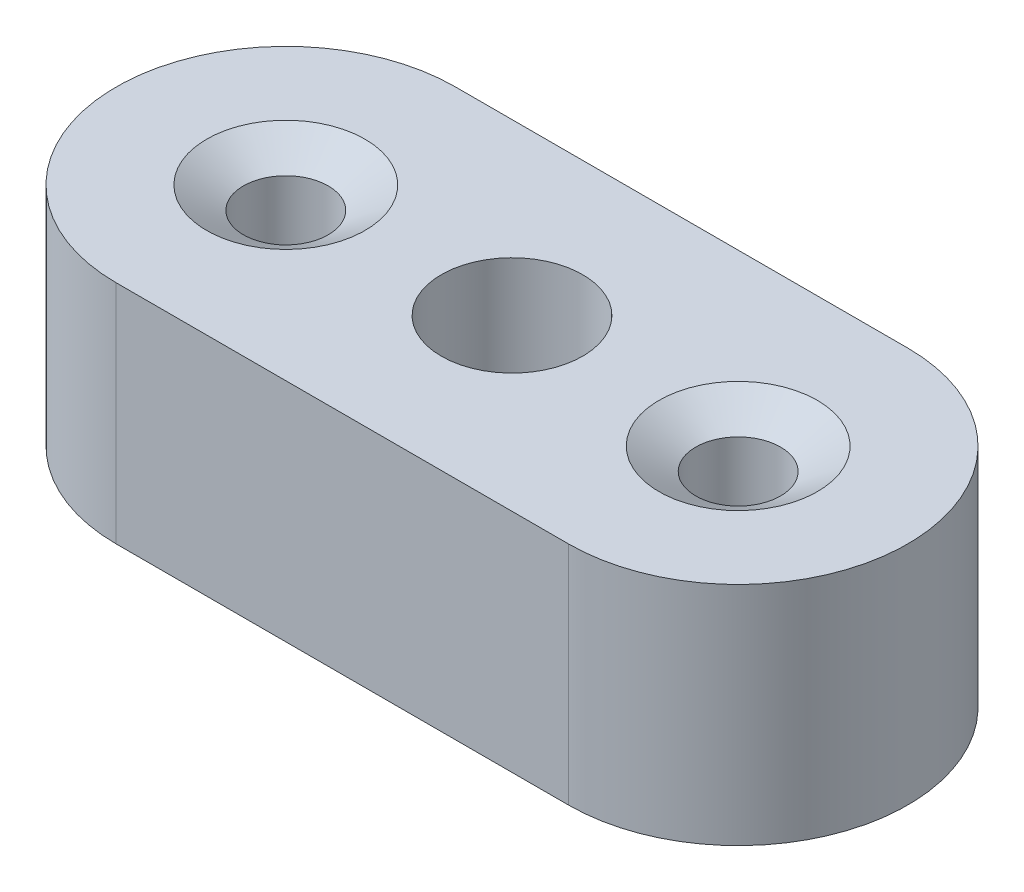
ISO-10303-21;
HEADER;
FILE_DESCRIPTION(('STEP AP214'),'2;1');
FILE_NAME('part.step','',(''),(''),'','','');
FILE_SCHEMA(('AUTOMOTIVE_DESIGN { 1 0 10303 214 1 1 1 1 }'));
ENDSEC;
DATA;
#1=APPLICATION_CONTEXT('core data for automotive mechanical design processes');
#2=APPLICATION_PROTOCOL_DEFINITION('international standard','automotive_design',2000,#1);
#3=PRODUCT_CONTEXT('',#1,'mechanical');
#4=PRODUCT('Part','Part','',(#3));
#5=PRODUCT_RELATED_PRODUCT_CATEGORY('part','',(#4));
#6=PRODUCT_DEFINITION_FORMATION('','',#4);
#7=PRODUCT_DEFINITION_CONTEXT('part definition',#1,'design');
#8=PRODUCT_DEFINITION('design','',#6,#7);
#9=PRODUCT_DEFINITION_SHAPE('','',#8);
#10=(LENGTH_UNIT() NAMED_UNIT(*) SI_UNIT(.MILLI.,.METRE.));
#11=(NAMED_UNIT(*) PLANE_ANGLE_UNIT() SI_UNIT($,.RADIAN.));
#12=(NAMED_UNIT(*) SI_UNIT($,.STERADIAN.) SOLID_ANGLE_UNIT());
#13=UNCERTAINTY_MEASURE_WITH_UNIT(LENGTH_MEASURE(1.E-05),#10,'distance_accuracy_value','');
#14=(GEOMETRIC_REPRESENTATION_CONTEXT(3) GLOBAL_UNCERTAINTY_ASSIGNED_CONTEXT((#13)) GLOBAL_UNIT_ASSIGNED_CONTEXT((#10,
#11,#12)) REPRESENTATION_CONTEXT('',''));
#15=CARTESIAN_POINT('',(0.,0.,0.));
#16=DIRECTION('',(0.,0.,1.));
#17=DIRECTION('',(1.,0.,0.));
#18=AXIS2_PLACEMENT_3D('',#15,#16,#17);
#19=CARTESIAN_POINT('',(-12.7,12.7,0.));
#20=DIRECTION('',(0.,1.,0.));
#21=DIRECTION('',(0.,0.,1.));
#22=AXIS2_PLACEMENT_3D('',#19,#20,#21);
#23=PLANE('',#22);
#24=CARTESIAN_POINT('',(12.7,12.7,0.));
#25=DIRECTION('',(0.,1.,0.));
#26=DIRECTION('',(0.,0.,-1.));
#27=AXIS2_PLACEMENT_3D('',#24,#25,#26);
#28=CIRCLE('',#27,4.445);
#29=CARTESIAN_POINT('',(12.7,12.7,-4.445));
#30=VERTEX_POINT('',#29);
#31=EDGE_CURVE('E126',#30,#30,#28,.T.);
#32=ORIENTED_EDGE('',*,*,#31,.F.);
#33=EDGE_LOOP('',(#32));
#34=FACE_BOUND('',#33,.T.);
#35=CARTESIAN_POINT('',(-12.7,12.7,0.));
#36=DIRECTION('',(0.,-1.,0.));
#37=DIRECTION('',(0.,0.,-1.));
#38=AXIS2_PLACEMENT_3D('',#35,#36,#37);
#39=CIRCLE('',#38,4.445);
#40=CARTESIAN_POINT('',(-12.7,12.7,-4.445));
#41=VERTEX_POINT('',#40);
#42=EDGE_CURVE('E115',#41,#41,#39,.T.);
#43=ORIENTED_EDGE('',*,*,#42,.T.);
#44=EDGE_LOOP('',(#43));
#45=FACE_BOUND('',#44,.T.);
#46=CARTESIAN_POINT('',(-12.7,12.7,0.));
#47=DIRECTION('',(0.,1.,0.));
#48=DIRECTION('',(0.,0.,1.));
#49=AXIS2_PLACEMENT_3D('',#46,#47,#48);
#50=CIRCLE('',#49,9.525);
#51=CARTESIAN_POINT('',(-12.7,12.7,-9.525));
#52=VERTEX_POINT('',#51);
#53=CARTESIAN_POINT('',(-12.7,12.7,9.525));
#54=VERTEX_POINT('',#53);
#55=EDGE_CURVE('E85',#52,#54,#50,.T.);
#56=ORIENTED_EDGE('',*,*,#55,.T.);
#57=DIRECTION('',(1.,0.,0.));
#58=VECTOR('',#57,1.);
#59=CARTESIAN_POINT('',(-12.7,12.7,9.525));
#60=LINE('',#59,#58);
#61=CARTESIAN_POINT('',(12.7,12.7,9.525));
#62=VERTEX_POINT('',#61);
#63=EDGE_CURVE('E80',#54,#62,#60,.T.);
#64=ORIENTED_EDGE('',*,*,#63,.T.);
#65=CARTESIAN_POINT('',(12.7,12.7,0.));
#66=DIRECTION('',(0.,1.,0.));
#67=DIRECTION('',(0.,0.,1.));
#68=AXIS2_PLACEMENT_3D('',#65,#66,#67);
#69=CIRCLE('',#68,9.525);
#70=CARTESIAN_POINT('',(12.7,12.7,-9.525));
#71=VERTEX_POINT('',#70);
#72=EDGE_CURVE('E83',#62,#71,#69,.T.);
#73=ORIENTED_EDGE('',*,*,#72,.T.);
#74=DIRECTION('',(-1.,0.,0.));
#75=VECTOR('',#74,1.);
#76=CARTESIAN_POINT('',(-12.7,12.7,-9.525));
#77=LINE('',#76,#75);
#78=EDGE_CURVE('E50',#71,#52,#77,.T.);
#79=ORIENTED_EDGE('',*,*,#78,.T.);
#80=EDGE_LOOP('',(#56,#64,#73,#79));
#81=FACE_BOUND('',#80,.T.);
#82=CARTESIAN_POINT('',(0.,12.7,0.));
#83=DIRECTION('',(0.,1.,0.));
#84=DIRECTION('',(0.,0.,1.));
#85=AXIS2_PLACEMENT_3D('',#82,#83,#84);
#86=CIRCLE('',#85,3.96875);
#87=CARTESIAN_POINT('',(0.,12.7,3.96875));
#88=VERTEX_POINT('',#87);
#89=EDGE_CURVE('E100',#88,#88,#86,.T.);
#90=ORIENTED_EDGE('',*,*,#89,.F.);
#91=EDGE_LOOP('',(#90));
#92=FACE_BOUND('',#91,.T.);
#93=ADVANCED_FACE('F33',(#34,#45,#81,#92),#23,.T.);
#94=CARTESIAN_POINT('',(-12.7,0.,0.));
#95=DIRECTION('',(0.,1.,0.));
#96=DIRECTION('',(0.,0.,1.));
#97=AXIS2_PLACEMENT_3D('',#94,#95,#96);
#98=PLANE('',#97);
#99=CARTESIAN_POINT('',(12.7,0.,0.));
#100=DIRECTION('',(0.,1.,0.));
#101=DIRECTION('',(0.,0.,-1.));
#102=AXIS2_PLACEMENT_3D('',#99,#100,#101);
#103=CIRCLE('',#102,2.38125);
#104=CARTESIAN_POINT('',(12.7,0.,-2.38125));
#105=VERTEX_POINT('',#104);
#106=EDGE_CURVE('E132',#105,#105,#103,.T.);
#107=ORIENTED_EDGE('',*,*,#106,.T.);
#108=EDGE_LOOP('',(#107));
#109=FACE_BOUND('',#108,.T.);
#110=CARTESIAN_POINT('',(-12.7,0.,0.));
#111=DIRECTION('',(0.,-1.,0.));
#112=DIRECTION('',(0.,0.,-1.));
#113=AXIS2_PLACEMENT_3D('',#110,#111,#112);
#114=CIRCLE('',#113,2.38125);
#115=CARTESIAN_POINT('',(-12.7,0.,-2.38125));
#116=VERTEX_POINT('',#115);
#117=EDGE_CURVE('E123',#116,#116,#114,.T.);
#118=ORIENTED_EDGE('',*,*,#117,.F.);
#119=EDGE_LOOP('',(#118));
#120=FACE_BOUND('',#119,.T.);
#121=CARTESIAN_POINT('',(-12.7,0.,0.));
#122=DIRECTION('',(0.,1.,0.));
#123=DIRECTION('',(0.,0.,1.));
#124=AXIS2_PLACEMENT_3D('',#121,#122,#123);
#125=CIRCLE('',#124,9.525);
#126=CARTESIAN_POINT('',(-12.7,0.,-9.525));
#127=VERTEX_POINT('',#126);
#128=CARTESIAN_POINT('',(-12.7,0.,9.525));
#129=VERTEX_POINT('',#128);
#130=EDGE_CURVE('E97',#127,#129,#125,.T.);
#131=ORIENTED_EDGE('',*,*,#130,.F.);
#132=DIRECTION('',(-1.,0.,0.));
#133=VECTOR('',#132,1.);
#134=CARTESIAN_POINT('',(-12.7,0.,-9.525));
#135=LINE('',#134,#133);
#136=CARTESIAN_POINT('',(12.7,0.,-9.525));
#137=VERTEX_POINT('',#136);
#138=EDGE_CURVE('E73',#137,#127,#135,.T.);
#139=ORIENTED_EDGE('',*,*,#138,.F.);
#140=CARTESIAN_POINT('',(12.7,0.,0.));
#141=DIRECTION('',(0.,1.,0.));
#142=DIRECTION('',(0.,0.,1.));
#143=AXIS2_PLACEMENT_3D('',#140,#141,#142);
#144=CIRCLE('',#143,9.525);
#145=CARTESIAN_POINT('',(12.7,0.,9.525));
#146=VERTEX_POINT('',#145);
#147=EDGE_CURVE('E67',#146,#137,#144,.T.);
#148=ORIENTED_EDGE('',*,*,#147,.F.);
#149=DIRECTION('',(1.,0.,0.));
#150=VECTOR('',#149,1.);
#151=CARTESIAN_POINT('',(-12.7,0.,9.525));
#152=LINE('',#151,#150);
#153=EDGE_CURVE('E89',#129,#146,#152,.T.);
#154=ORIENTED_EDGE('',*,*,#153,.F.);
#155=EDGE_LOOP('',(#131,#139,#148,#154));
#156=FACE_BOUND('',#155,.T.);
#157=CARTESIAN_POINT('',(0.,0.,0.));
#158=DIRECTION('',(0.,1.,0.));
#159=DIRECTION('',(0.,0.,1.));
#160=AXIS2_PLACEMENT_3D('',#157,#158,#159);
#161=CIRCLE('',#160,3.96875);
#162=CARTESIAN_POINT('',(0.,0.,3.96875));
#163=VERTEX_POINT('',#162);
#164=EDGE_CURVE('E112',#163,#163,#161,.T.);
#165=ORIENTED_EDGE('',*,*,#164,.T.);
#166=EDGE_LOOP('',(#165));
#167=FACE_BOUND('',#166,.T.);
#168=ADVANCED_FACE('F108',(#109,#120,#156,#167),#98,.F.);
#169=CARTESIAN_POINT('',(-12.7,12.7,0.));
#170=DIRECTION('',(0.,-1.,0.));
#171=DIRECTION('',(0.,0.,-1.));
#172=AXIS2_PLACEMENT_3D('',#169,#170,#171);
#173=CYLINDRICAL_SURFACE('',#172,9.525);
#174=ORIENTED_EDGE('',*,*,#130,.T.);
#175=DIRECTION('',(0.,-1.,0.));
#176=VECTOR('',#175,1.);
#177=CARTESIAN_POINT('',(-12.7,12.7,9.525));
#178=LINE('',#177,#176);
#179=EDGE_CURVE('E11',#54,#129,#178,.T.);
#180=ORIENTED_EDGE('',*,*,#179,.F.);
#181=ORIENTED_EDGE('',*,*,#55,.F.);
#182=DIRECTION('',(0.,-1.,0.));
#183=VECTOR('',#182,1.);
#184=CARTESIAN_POINT('',(-12.7,12.7,-9.525));
#185=LINE('',#184,#183);
#186=EDGE_CURVE('E93',#52,#127,#185,.T.);
#187=ORIENTED_EDGE('',*,*,#186,.T.);
#188=EDGE_LOOP('',(#174,#180,#181,#187));
#189=FACE_BOUND('',#188,.T.);
#190=ADVANCED_FACE('F35',(#189),#173,.T.);
#191=CARTESIAN_POINT('',(-12.7,12.7,9.525));
#192=DIRECTION('',(0.,0.,-1.));
#193=DIRECTION('',(-1.,0.,0.));
#194=AXIS2_PLACEMENT_3D('',#191,#192,#193);
#195=PLANE('',#194);
#196=ORIENTED_EDGE('',*,*,#153,.T.);
#197=DIRECTION('',(0.,-1.,0.));
#198=VECTOR('',#197,1.);
#199=CARTESIAN_POINT('',(12.7,12.7,9.525));
#200=LINE('',#199,#198);
#201=EDGE_CURVE('E42',#62,#146,#200,.T.);
#202=ORIENTED_EDGE('',*,*,#201,.F.);
#203=ORIENTED_EDGE('',*,*,#63,.F.);
#204=ORIENTED_EDGE('',*,*,#179,.T.);
#205=EDGE_LOOP('',(#196,#202,#203,#204));
#206=FACE_BOUND('',#205,.T.);
#207=ADVANCED_FACE('F88',(#206),#195,.F.);
#208=CARTESIAN_POINT('',(12.7,12.7,0.));
#209=DIRECTION('',(0.,-1.,0.));
#210=DIRECTION('',(0.,0.,-1.));
#211=AXIS2_PLACEMENT_3D('',#208,#209,#210);
#212=CYLINDRICAL_SURFACE('',#211,9.525);
#213=ORIENTED_EDGE('',*,*,#147,.T.);
#214=DIRECTION('',(0.,-1.,0.));
#215=VECTOR('',#214,1.);
#216=CARTESIAN_POINT('',(12.7,12.7,-9.525));
#217=LINE('',#216,#215);
#218=EDGE_CURVE('E90',#71,#137,#217,.T.);
#219=ORIENTED_EDGE('',*,*,#218,.F.);
#220=ORIENTED_EDGE('',*,*,#72,.F.);
#221=ORIENTED_EDGE('',*,*,#201,.T.);
#222=EDGE_LOOP('',(#213,#219,#220,#221));
#223=FACE_BOUND('',#222,.T.);
#224=ADVANCED_FACE('F91',(#223),#212,.T.);
#225=CARTESIAN_POINT('',(-12.7,12.7,-9.525));
#226=DIRECTION('',(0.,0.,1.));
#227=DIRECTION('',(1.,0.,0.));
#228=AXIS2_PLACEMENT_3D('',#225,#226,#227);
#229=PLANE('',#228);
#230=ORIENTED_EDGE('',*,*,#138,.T.);
#231=ORIENTED_EDGE('',*,*,#186,.F.);
#232=ORIENTED_EDGE('',*,*,#78,.F.);
#233=ORIENTED_EDGE('',*,*,#218,.T.);
#234=EDGE_LOOP('',(#230,#231,#232,#233));
#235=FACE_BOUND('',#234,.T.);
#236=ADVANCED_FACE('F105',(#235),#229,.F.);
#237=CARTESIAN_POINT('',(0.,12.7,0.));
#238=DIRECTION('',(0.,-1.,0.));
#239=DIRECTION('',(0.,0.,-1.));
#240=AXIS2_PLACEMENT_3D('',#237,#238,#239);
#241=CYLINDRICAL_SURFACE('',#240,3.96875);
#242=ORIENTED_EDGE('',*,*,#89,.T.);
#243=EDGE_LOOP('',(#242));
#244=FACE_BOUND('',#243,.T.);
#245=ORIENTED_EDGE('',*,*,#164,.F.);
#246=EDGE_LOOP('',(#245));
#247=FACE_BOUND('',#246,.T.);
#248=ADVANCED_FACE('F158',(#244,#247),#241,.F.);
#249=CARTESIAN_POINT('',(-12.7,12.7,0.));
#250=DIRECTION('',(0.,1.,0.));
#251=DIRECTION('',(0.,0.,1.));
#252=AXIS2_PLACEMENT_3D('',#249,#250,#251);
#253=CONICAL_SURFACE('',#252,4.445,1.02974425867665);
#254=CARTESIAN_POINT('',(-12.7,11.4599738974819,0.));
#255=DIRECTION('',(0.,-1.,0.));
#256=DIRECTION('',(0.,0.,-1.));
#257=AXIS2_PLACEMENT_3D('',#254,#255,#256);
#258=CIRCLE('',#257,2.38125);
#259=CARTESIAN_POINT('',(-12.7,11.4599738974819,-2.38125));
#260=VERTEX_POINT('',#259);
#261=EDGE_CURVE('E120',#260,#260,#258,.T.);
#262=ORIENTED_EDGE('',*,*,#261,.T.);
#263=EDGE_LOOP('',(#262));
#264=FACE_BOUND('',#263,.T.);
#265=ORIENTED_EDGE('',*,*,#42,.F.);
#266=EDGE_LOOP('',(#265));
#267=FACE_BOUND('',#266,.T.);
#268=ADVANCED_FACE('F156',(#264,#267),#253,.F.);
#269=CARTESIAN_POINT('',(-12.7,0.,0.));
#270=DIRECTION('',(0.,-1.,0.));
#271=DIRECTION('',(0.,0.,-1.));
#272=AXIS2_PLACEMENT_3D('',#269,#270,#271);
#273=CYLINDRICAL_SURFACE('',#272,2.38125);
#274=ORIENTED_EDGE('',*,*,#117,.T.);
#275=EDGE_LOOP('',(#274));
#276=FACE_BOUND('',#275,.T.);
#277=ORIENTED_EDGE('',*,*,#261,.F.);
#278=EDGE_LOOP('',(#277));
#279=FACE_BOUND('',#278,.T.);
#280=ADVANCED_FACE('F147',(#276,#279),#273,.F.);
#281=CARTESIAN_POINT('',(12.7,12.7,0.));
#282=DIRECTION('',(0.,1.,0.));
#283=DIRECTION('',(0.,0.,1.));
#284=AXIS2_PLACEMENT_3D('',#281,#282,#283);
#285=CONICAL_SURFACE('',#284,4.445,1.02974425867665);
#286=CARTESIAN_POINT('',(12.7,11.4599738974819,0.));
#287=DIRECTION('',(0.,1.,0.));
#288=DIRECTION('',(0.,0.,-1.));
#289=AXIS2_PLACEMENT_3D('',#286,#287,#288);
#290=CIRCLE('',#289,2.38125);
#291=CARTESIAN_POINT('',(12.7,11.4599738974819,-2.38125));
#292=VERTEX_POINT('',#291);
#293=EDGE_CURVE('E129',#292,#292,#290,.T.);
#294=ORIENTED_EDGE('',*,*,#293,.F.);
#295=EDGE_LOOP('',(#294));
#296=FACE_BOUND('',#295,.T.);
#297=ORIENTED_EDGE('',*,*,#31,.T.);
#298=EDGE_LOOP('',(#297));
#299=FACE_BOUND('',#298,.T.);
#300=ADVANCED_FACE('F141',(#296,#299),#285,.F.);
#301=CARTESIAN_POINT('',(12.7,0.,0.));
#302=DIRECTION('',(0.,-1.,0.));
#303=DIRECTION('',(0.,0.,-1.));
#304=AXIS2_PLACEMENT_3D('',#301,#302,#303);
#305=CYLINDRICAL_SURFACE('',#304,2.38125);
#306=ORIENTED_EDGE('',*,*,#106,.F.);
#307=EDGE_LOOP('',(#306));
#308=FACE_BOUND('',#307,.T.);
#309=ORIENTED_EDGE('',*,*,#293,.T.);
#310=EDGE_LOOP('',(#309));
#311=FACE_BOUND('',#310,.T.);
#312=ADVANCED_FACE('F138',(#308,#311),#305,.F.);
#313=CLOSED_SHELL('',(#93,#168,#190,#207,#224,#236,#248,#268,#280,#300,#312));
#314=MANIFOLD_SOLID_BREP('B2',#313);
#315=ADVANCED_BREP_SHAPE_REPRESENTATION('',(#18,#314),#14);
#316=SHAPE_DEFINITION_REPRESENTATION(#9,#315);
ENDSEC;
END-ISO-10303-21;
